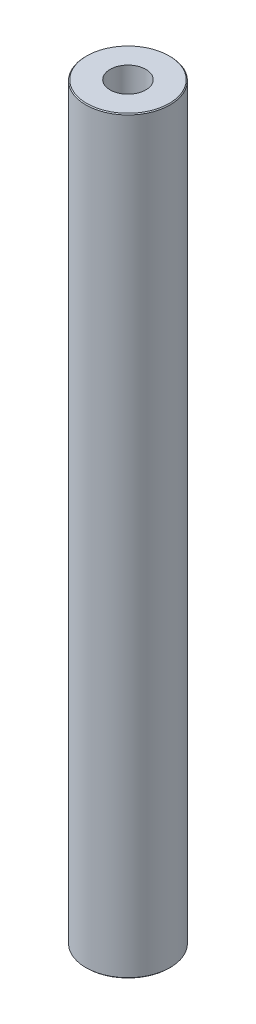
ISO-10303-21;
HEADER;
FILE_DESCRIPTION(('STEP AP214'),'2;1');
FILE_NAME('part.step','',(''),(''),'','','');
FILE_SCHEMA(('AUTOMOTIVE_DESIGN { 1 0 10303 214 1 1 1 1 }'));
ENDSEC;
DATA;
#1=APPLICATION_CONTEXT('core data for automotive mechanical design processes');
#2=APPLICATION_PROTOCOL_DEFINITION('international standard','automotive_design',2000,#1);
#3=PRODUCT_CONTEXT('',#1,'mechanical');
#4=PRODUCT('Part','Part','',(#3));
#5=PRODUCT_RELATED_PRODUCT_CATEGORY('part','',(#4));
#6=PRODUCT_DEFINITION_FORMATION('','',#4);
#7=PRODUCT_DEFINITION_CONTEXT('part definition',#1,'design');
#8=PRODUCT_DEFINITION('design','',#6,#7);
#9=PRODUCT_DEFINITION_SHAPE('','',#8);
#10=(LENGTH_UNIT() NAMED_UNIT(*) SI_UNIT(.MILLI.,.METRE.));
#11=(NAMED_UNIT(*) PLANE_ANGLE_UNIT() SI_UNIT($,.RADIAN.));
#12=(NAMED_UNIT(*) SI_UNIT($,.STERADIAN.) SOLID_ANGLE_UNIT());
#13=UNCERTAINTY_MEASURE_WITH_UNIT(LENGTH_MEASURE(1.E-05),#10,'distance_accuracy_value','');
#14=(GEOMETRIC_REPRESENTATION_CONTEXT(3) GLOBAL_UNCERTAINTY_ASSIGNED_CONTEXT((#13)) GLOBAL_UNIT_ASSIGNED_CONTEXT((#10,
#11,#12)) REPRESENTATION_CONTEXT('',''));
#15=CARTESIAN_POINT('',(0.,0.,0.));
#16=DIRECTION('',(0.,0.,1.));
#17=DIRECTION('',(1.,0.,0.));
#18=AXIS2_PLACEMENT_3D('',#15,#16,#17);
#19=CARTESIAN_POINT('',(0.,355.88432975016,0.));
#20=DIRECTION('',(0.,-1.,0.));
#21=DIRECTION('',(0.,0.,-1.));
#22=AXIS2_PLACEMENT_3D('',#19,#20,#21);
#23=CYLINDRICAL_SURFACE('',#22,20.);
#24=CARTESIAN_POINT('',(0.,355.464431192626,0.));
#25=DIRECTION('',(0.,1.,0.));
#26=DIRECTION('',(0.,0.,1.));
#27=AXIS2_PLACEMENT_3D('',#24,#25,#26);
#28=CIRCLE('',#27,20.);
#29=CARTESIAN_POINT('',(0.,355.464431192626,20.));
#30=VERTEX_POINT('',#29);
#31=EDGE_CURVE('E50',#30,#30,#28,.F.);
#32=ORIENTED_EDGE('',*,*,#31,.T.);
#33=EDGE_LOOP('',(#32));
#34=FACE_BOUND('',#33,.T.);
#35=CARTESIAN_POINT('',(0.,0.419898557533882,0.));
#36=DIRECTION('',(0.,1.,0.));
#37=DIRECTION('',(0.,0.,1.));
#38=AXIS2_PLACEMENT_3D('',#35,#36,#37);
#39=CIRCLE('',#38,20.);
#40=CARTESIAN_POINT('',(0.,0.419898557533882,20.));
#41=VERTEX_POINT('',#40);
#42=EDGE_CURVE('E51',#41,#41,#39,.T.);
#43=ORIENTED_EDGE('',*,*,#42,.T.);
#44=EDGE_LOOP('',(#43));
#45=FACE_BOUND('',#44,.T.);
#46=ADVANCED_FACE('F39',(#34,#45),#23,.T.);
#47=CARTESIAN_POINT('',(0.,355.88432975016,0.));
#48=DIRECTION('',(0.,1.,0.));
#49=DIRECTION('',(0.,0.,1.));
#50=AXIS2_PLACEMENT_3D('',#47,#48,#49);
#51=PLANE('',#50);
#52=CARTESIAN_POINT('',(0.,355.88432975016,0.));
#53=DIRECTION('',(0.,1.,0.));
#54=DIRECTION('',(0.,0.,1.));
#55=AXIS2_PLACEMENT_3D('',#52,#53,#54);
#56=CIRCLE('',#55,19.5801014424661);
#57=CARTESIAN_POINT('',(0.,355.88432975016,19.5801014424661));
#58=VERTEX_POINT('',#57);
#59=EDGE_CURVE('E54',#58,#58,#56,.T.);
#60=ORIENTED_EDGE('',*,*,#59,.T.);
#61=EDGE_LOOP('',(#60));
#62=FACE_BOUND('',#61,.T.);
#63=CARTESIAN_POINT('',(0.,355.88432975016,0.));
#64=DIRECTION('',(0.,1.,0.));
#65=DIRECTION('',(0.,0.,1.));
#66=AXIS2_PLACEMENT_3D('',#63,#64,#65);
#67=CIRCLE('',#66,8.48999767195673);
#68=CARTESIAN_POINT('',(0.,355.88432975016,8.48999767195673));
#69=VERTEX_POINT('',#68);
#70=EDGE_CURVE('E58',#69,#69,#67,.T.);
#71=ORIENTED_EDGE('',*,*,#70,.F.);
#72=EDGE_LOOP('',(#71));
#73=FACE_BOUND('',#72,.T.);
#74=ADVANCED_FACE('F69',(#62,#73),#51,.T.);
#75=CARTESIAN_POINT('',(0.,0.,0.));
#76=DIRECTION('',(0.,1.,0.));
#77=DIRECTION('',(0.,0.,1.));
#78=AXIS2_PLACEMENT_3D('',#75,#76,#77);
#79=PLANE('',#78);
#80=CARTESIAN_POINT('',(0.,0.,0.));
#81=DIRECTION('',(0.,1.,0.));
#82=DIRECTION('',(0.,0.,1.));
#83=AXIS2_PLACEMENT_3D('',#80,#81,#82);
#84=CIRCLE('',#83,19.5801014424661);
#85=CARTESIAN_POINT('',(0.,0.,19.5801014424661));
#86=VERTEX_POINT('',#85);
#87=EDGE_CURVE('E10',#86,#86,#84,.F.);
#88=ORIENTED_EDGE('',*,*,#87,.T.);
#89=EDGE_LOOP('',(#88));
#90=FACE_BOUND('',#89,.T.);
#91=CARTESIAN_POINT('',(0.,0.,0.));
#92=DIRECTION('',(0.,1.,0.));
#93=DIRECTION('',(0.,0.,1.));
#94=AXIS2_PLACEMENT_3D('',#91,#92,#93);
#95=CIRCLE('',#94,8.48999767195673);
#96=CARTESIAN_POINT('',(0.,0.,8.48999767195673));
#97=VERTEX_POINT('',#96);
#98=EDGE_CURVE('E63',#97,#97,#95,.T.);
#99=ORIENTED_EDGE('',*,*,#98,.T.);
#100=EDGE_LOOP('',(#99));
#101=FACE_BOUND('',#100,.T.);
#102=ADVANCED_FACE('F75',(#90,#101),#79,.F.);
#103=CARTESIAN_POINT('',(0.,355.88432975016,0.));
#104=DIRECTION('',(0.,-1.,0.));
#105=DIRECTION('',(0.,0.,-1.));
#106=AXIS2_PLACEMENT_3D('',#103,#104,#105);
#107=CYLINDRICAL_SURFACE('',#106,8.48999767195673);
#108=ORIENTED_EDGE('',*,*,#70,.T.);
#109=EDGE_LOOP('',(#108));
#110=FACE_BOUND('',#109,.T.);
#111=ORIENTED_EDGE('',*,*,#98,.F.);
#112=EDGE_LOOP('',(#111));
#113=FACE_BOUND('',#112,.T.);
#114=ADVANCED_FACE('F70',(#110,#113),#107,.F.);
#115=CARTESIAN_POINT('',(0.,355.88432975016,0.));
#116=DIRECTION('',(0.,-1.,0.));
#117=DIRECTION('',(0.,0.,-1.));
#118=AXIS2_PLACEMENT_3D('',#115,#116,#117);
#119=CONICAL_SURFACE('',#118,19.5801014424661,0.785398163397428);
#120=ORIENTED_EDGE('',*,*,#31,.F.);
#121=EDGE_LOOP('',(#120));
#122=FACE_BOUND('',#121,.T.);
#123=ORIENTED_EDGE('',*,*,#59,.F.);
#124=EDGE_LOOP('',(#123));
#125=FACE_BOUND('',#124,.T.);
#126=ADVANCED_FACE('F81',(#122,#125),#119,.T.);
#127=CARTESIAN_POINT('',(0.,0.419898557533882,0.));
#128=DIRECTION('',(0.,1.,0.));
#129=DIRECTION('',(0.,0.,1.));
#130=AXIS2_PLACEMENT_3D('',#127,#128,#129);
#131=CONICAL_SURFACE('',#130,20.,0.785398163397461);
#132=ORIENTED_EDGE('',*,*,#87,.F.);
#133=EDGE_LOOP('',(#132));
#134=FACE_BOUND('',#133,.T.);
#135=ORIENTED_EDGE('',*,*,#42,.F.);
#136=EDGE_LOOP('',(#135));
#137=FACE_BOUND('',#136,.T.);
#138=ADVANCED_FACE('F45',(#134,#137),#131,.T.);
#139=CLOSED_SHELL('',(#46,#74,#102,#114,#126,#138));
#140=MANIFOLD_SOLID_BREP('B2',#139);
#141=ADVANCED_BREP_SHAPE_REPRESENTATION('',(#18,#140),#14);
#142=SHAPE_DEFINITION_REPRESENTATION(#9,#141);
ENDSEC;
END-ISO-10303-21;
